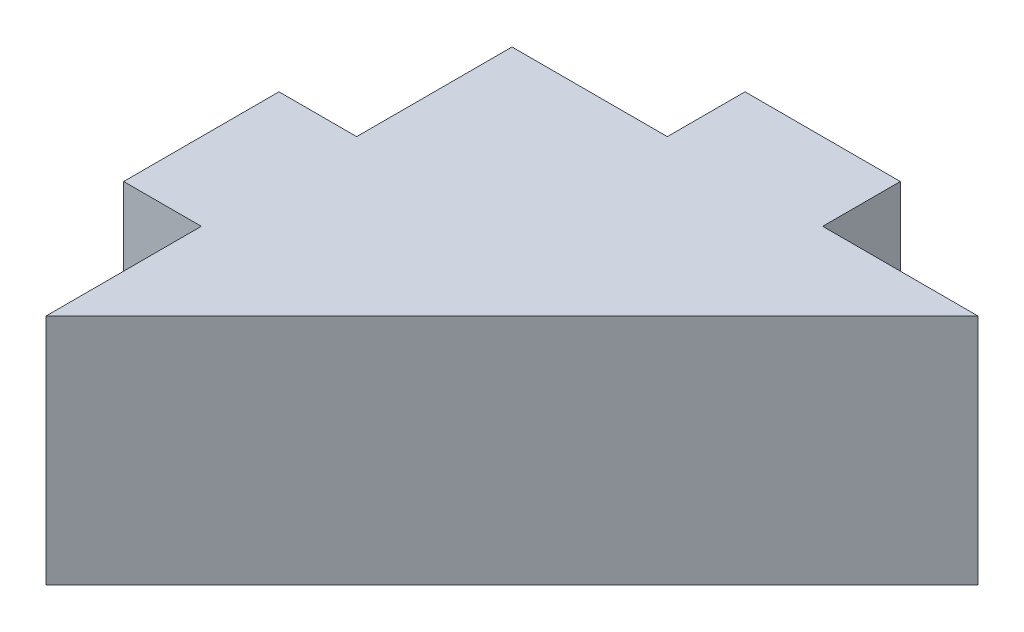
ISO-10303-21;
HEADER;
FILE_DESCRIPTION(('STEP AP214'),'2;1');
FILE_NAME('part.step','',(''),(''),'','','');
FILE_SCHEMA(('AUTOMOTIVE_DESIGN { 1 0 10303 214 1 1 1 1 }'));
ENDSEC;
DATA;
#1=APPLICATION_CONTEXT('core data for automotive mechanical design processes');
#2=APPLICATION_PROTOCOL_DEFINITION('international standard','automotive_design',2000,#1);
#3=PRODUCT_CONTEXT('',#1,'mechanical');
#4=PRODUCT('Part','Part','',(#3));
#5=PRODUCT_RELATED_PRODUCT_CATEGORY('part','',(#4));
#6=PRODUCT_DEFINITION_FORMATION('','',#4);
#7=PRODUCT_DEFINITION_CONTEXT('part definition',#1,'design');
#8=PRODUCT_DEFINITION('design','',#6,#7);
#9=PRODUCT_DEFINITION_SHAPE('','',#8);
#10=(LENGTH_UNIT() NAMED_UNIT(*) SI_UNIT(.MILLI.,.METRE.));
#11=(NAMED_UNIT(*) PLANE_ANGLE_UNIT() SI_UNIT($,.RADIAN.));
#12=(NAMED_UNIT(*) SI_UNIT($,.STERADIAN.) SOLID_ANGLE_UNIT());
#13=UNCERTAINTY_MEASURE_WITH_UNIT(LENGTH_MEASURE(1.E-05),#10,'distance_accuracy_value','');
#14=(GEOMETRIC_REPRESENTATION_CONTEXT(3) GLOBAL_UNCERTAINTY_ASSIGNED_CONTEXT((#13)) GLOBAL_UNIT_ASSIGNED_CONTEXT((#10,
#11,#12)) REPRESENTATION_CONTEXT('',''));
#15=CARTESIAN_POINT('',(0.,0.,0.));
#16=DIRECTION('',(0.,0.,1.));
#17=DIRECTION('',(1.,0.,0.));
#18=AXIS2_PLACEMENT_3D('',#15,#16,#17);
#19=CARTESIAN_POINT('',(0.,15.,0.));
#20=DIRECTION('',(1.,0.,0.));
#21=DIRECTION('',(0.,0.,-1.));
#22=AXIS2_PLACEMENT_3D('',#19,#20,#21);
#23=PLANE('',#22);
#24=DIRECTION('',(0.,0.,1.));
#25=VECTOR('',#24,1.);
#26=CARTESIAN_POINT('',(0.,15.,0.));
#27=LINE('',#26,#25);
#28=CARTESIAN_POINT('',(0.,15.,20.));
#29=VERTEX_POINT('',#28);
#30=CARTESIAN_POINT('',(0.,15.,30.));
#31=VERTEX_POINT('',#30);
#32=EDGE_CURVE('E209',#29,#31,#27,.T.);
#33=ORIENTED_EDGE('',*,*,#32,.F.);
#34=DIRECTION('',(0.,-1.,0.));
#35=VECTOR('',#34,1.);
#36=CARTESIAN_POINT('',(0.,15.,20.));
#37=LINE('',#36,#35);
#38=CARTESIAN_POINT('',(0.,0.,20.));
#39=VERTEX_POINT('',#38);
#40=EDGE_CURVE('E141',#29,#39,#37,.T.);
#41=ORIENTED_EDGE('',*,*,#40,.T.);
#42=DIRECTION('',(0.,0.,1.));
#43=VECTOR('',#42,1.);
#44=CARTESIAN_POINT('',(0.,0.,0.));
#45=LINE('',#44,#43);
#46=CARTESIAN_POINT('',(0.,0.,30.));
#47=VERTEX_POINT('',#46);
#48=EDGE_CURVE('E204',#39,#47,#45,.T.);
#49=ORIENTED_EDGE('',*,*,#48,.T.);
#50=DIRECTION('',(0.,-1.,0.));
#51=VECTOR('',#50,1.);
#52=CARTESIAN_POINT('',(0.,15.,30.));
#53=LINE('',#52,#51);
#54=EDGE_CURVE('E228',#31,#47,#53,.T.);
#55=ORIENTED_EDGE('',*,*,#54,.F.);
#56=EDGE_LOOP('',(#33,#41,#49,#55));
#57=FACE_BOUND('',#56,.T.);
#58=ADVANCED_FACE('F39',(#57),#23,.F.);
#59=CARTESIAN_POINT('',(0.,15.,0.));
#60=DIRECTION('',(0.,0.,1.));
#61=DIRECTION('',(1.,0.,0.));
#62=AXIS2_PLACEMENT_3D('',#59,#60,#61);
#63=PLANE('',#62);
#64=DIRECTION('',(0.,-1.,0.));
#65=VECTOR('',#64,1.);
#66=CARTESIAN_POINT('',(20.,15.,0.));
#67=LINE('',#66,#65);
#68=CARTESIAN_POINT('',(20.,15.,0.));
#69=VERTEX_POINT('',#68);
#70=CARTESIAN_POINT('',(20.,0.,0.));
#71=VERTEX_POINT('',#70);
#72=EDGE_CURVE('E63',#69,#71,#67,.T.);
#73=ORIENTED_EDGE('',*,*,#72,.F.);
#74=DIRECTION('',(-1.,0.,0.));
#75=VECTOR('',#74,1.);
#76=CARTESIAN_POINT('',(0.,15.,0.));
#77=LINE('',#76,#75);
#78=CARTESIAN_POINT('',(30.,15.,0.));
#79=VERTEX_POINT('',#78);
#80=EDGE_CURVE('E210',#79,#69,#77,.T.);
#81=ORIENTED_EDGE('',*,*,#80,.F.);
#82=DIRECTION('',(0.,-1.,0.));
#83=VECTOR('',#82,1.);
#84=CARTESIAN_POINT('',(30.,15.,0.));
#85=LINE('',#84,#83);
#86=CARTESIAN_POINT('',(30.,0.,0.));
#87=VERTEX_POINT('',#86);
#88=EDGE_CURVE('E224',#79,#87,#85,.T.);
#89=ORIENTED_EDGE('',*,*,#88,.T.);
#90=DIRECTION('',(-1.,0.,0.));
#91=VECTOR('',#90,1.);
#92=CARTESIAN_POINT('',(0.,0.,0.));
#93=LINE('',#92,#91);
#94=EDGE_CURVE('E218',#87,#71,#93,.T.);
#95=ORIENTED_EDGE('',*,*,#94,.T.);
#96=EDGE_LOOP('',(#73,#81,#89,#95));
#97=FACE_BOUND('',#96,.T.);
#98=ADVANCED_FACE('F243',(#97),#63,.F.);
#99=DIRECTION('',(0.,1.,0.));
#100=VECTOR('',#99,1.);
#101=CARTESIAN_POINT('',(10.,15.,0.));
#102=LINE('',#101,#100);
#103=CARTESIAN_POINT('',(9.99999999999999,0.,0.));
#104=VERTEX_POINT('',#103);
#105=CARTESIAN_POINT('',(10.,15.,0.));
#106=VERTEX_POINT('',#105);
#107=EDGE_CURVE('E174',#104,#106,#102,.T.);
#108=ORIENTED_EDGE('',*,*,#107,.F.);
#109=CARTESIAN_POINT('',(0.,0.,0.));
#110=VERTEX_POINT('',#109);
#111=EDGE_CURVE('E217',#104,#110,#93,.T.);
#112=ORIENTED_EDGE('',*,*,#111,.T.);
#113=DIRECTION('',(0.,-1.,0.));
#114=VECTOR('',#113,1.);
#115=CARTESIAN_POINT('',(0.,15.,0.));
#116=LINE('',#115,#114);
#117=CARTESIAN_POINT('',(0.,15.,0.));
#118=VERTEX_POINT('',#117);
#119=EDGE_CURVE('E213',#118,#110,#116,.T.);
#120=ORIENTED_EDGE('',*,*,#119,.F.);
#121=EDGE_CURVE('E208',#106,#118,#77,.T.);
#122=ORIENTED_EDGE('',*,*,#121,.F.);
#123=EDGE_LOOP('',(#108,#112,#120,#122));
#124=FACE_BOUND('',#123,.T.);
#125=ADVANCED_FACE('F258',(#124),#63,.F.);
#126=CARTESIAN_POINT('',(0.,0.,9.99999999999999));
#127=VERTEX_POINT('',#126);
#128=EDGE_CURVE('E214',#110,#127,#45,.T.);
#129=ORIENTED_EDGE('',*,*,#128,.T.);
#130=DIRECTION('',(0.,1.,0.));
#131=VECTOR('',#130,1.);
#132=CARTESIAN_POINT('',(0.,15.,10.));
#133=LINE('',#132,#131);
#134=CARTESIAN_POINT('',(0.,15.,9.99999999999999));
#135=VERTEX_POINT('',#134);
#136=EDGE_CURVE('E153',#127,#135,#133,.T.);
#137=ORIENTED_EDGE('',*,*,#136,.T.);
#138=EDGE_CURVE('E205',#118,#135,#27,.T.);
#139=ORIENTED_EDGE('',*,*,#138,.F.);
#140=ORIENTED_EDGE('',*,*,#119,.T.);
#141=EDGE_LOOP('',(#129,#137,#139,#140));
#142=FACE_BOUND('',#141,.T.);
#143=ADVANCED_FACE('F263',(#142),#23,.F.);
#144=CARTESIAN_POINT('',(0.,15.,0.));
#145=DIRECTION('',(0.,1.,0.));
#146=DIRECTION('',(0.,0.,1.));
#147=AXIS2_PLACEMENT_3D('',#144,#145,#146);
#148=PLANE('',#147);
#149=ORIENTED_EDGE('',*,*,#32,.T.);
#150=DIRECTION('',(-0.707106781186549,0.,0.707106781186546));
#151=VECTOR('',#150,1.);
#152=CARTESIAN_POINT('',(14.9999999999999,15.,15.));
#153=LINE('',#152,#151);
#154=EDGE_CURVE('E11',#31,#79,#153,.F.);
#155=ORIENTED_EDGE('',*,*,#154,.T.);
#156=ORIENTED_EDGE('',*,*,#80,.T.);
#157=DIRECTION('',(0.,0.,1.));
#158=VECTOR('',#157,1.);
#159=CARTESIAN_POINT('',(20.,15.,-5.));
#160=LINE('',#159,#158);
#161=CARTESIAN_POINT('',(20.,15.,-5.));
#162=VERTEX_POINT('',#161);
#163=EDGE_CURVE('E183',#162,#69,#160,.T.);
#164=ORIENTED_EDGE('',*,*,#163,.F.);
#165=DIRECTION('',(1.,0.,0.));
#166=VECTOR('',#165,1.);
#167=CARTESIAN_POINT('',(20.,15.,-5.));
#168=LINE('',#167,#166);
#169=CARTESIAN_POINT('',(10.,15.,-5.));
#170=VERTEX_POINT('',#169);
#171=EDGE_CURVE('E180',#170,#162,#168,.T.);
#172=ORIENTED_EDGE('',*,*,#171,.F.);
#173=DIRECTION('',(0.,0.,1.));
#174=VECTOR('',#173,1.);
#175=CARTESIAN_POINT('',(10.,15.,-5.));
#176=LINE('',#175,#174);
#177=EDGE_CURVE('E192',#170,#106,#176,.T.);
#178=ORIENTED_EDGE('',*,*,#177,.T.);
#179=ORIENTED_EDGE('',*,*,#121,.T.);
#180=ORIENTED_EDGE('',*,*,#138,.T.);
#181=DIRECTION('',(1.,0.,0.));
#182=VECTOR('',#181,1.);
#183=CARTESIAN_POINT('',(-5.,15.,10.));
#184=LINE('',#183,#182);
#185=CARTESIAN_POINT('',(-5.,15.,10.));
#186=VERTEX_POINT('',#185);
#187=EDGE_CURVE('E55',#186,#135,#184,.T.);
#188=ORIENTED_EDGE('',*,*,#187,.F.);
#189=DIRECTION('',(0.,0.,1.));
#190=VECTOR('',#189,1.);
#191=CARTESIAN_POINT('',(-5.,15.,20.));
#192=LINE('',#191,#190);
#193=CARTESIAN_POINT('',(-5.,15.,20.));
#194=VERTEX_POINT('',#193);
#195=EDGE_CURVE('E150',#186,#194,#192,.T.);
#196=ORIENTED_EDGE('',*,*,#195,.T.);
#197=DIRECTION('',(1.,0.,0.));
#198=VECTOR('',#197,1.);
#199=CARTESIAN_POINT('',(-5.,15.,20.));
#200=LINE('',#199,#198);
#201=EDGE_CURVE('E135',#194,#29,#200,.T.);
#202=ORIENTED_EDGE('',*,*,#201,.T.);
#203=EDGE_LOOP('',(#149,#155,#156,#164,#172,#178,#179,#180,#188,#196,#202));
#204=FACE_BOUND('',#203,.T.);
#205=ADVANCED_FACE('F155',(#204),#148,.T.);
#206=CARTESIAN_POINT('',(0.,0.,0.));
#207=DIRECTION('',(0.,1.,0.));
#208=DIRECTION('',(0.,0.,1.));
#209=AXIS2_PLACEMENT_3D('',#206,#207,#208);
#210=PLANE('',#209);
#211=ORIENTED_EDGE('',*,*,#94,.F.);
#212=DIRECTION('',(0.707106781186549,0.,-0.707106781186546));
#213=VECTOR('',#212,1.);
#214=CARTESIAN_POINT('',(30.,0.,0.));
#215=LINE('',#214,#213);
#216=EDGE_CURVE('E48',#87,#47,#215,.F.);
#217=ORIENTED_EDGE('',*,*,#216,.T.);
#218=ORIENTED_EDGE('',*,*,#48,.F.);
#219=DIRECTION('',(1.,0.,0.));
#220=VECTOR('',#219,1.);
#221=CARTESIAN_POINT('',(-5.,0.,20.));
#222=LINE('',#221,#220);
#223=CARTESIAN_POINT('',(-5.,0.,20.));
#224=VERTEX_POINT('',#223);
#225=EDGE_CURVE('E162',#224,#39,#222,.T.);
#226=ORIENTED_EDGE('',*,*,#225,.F.);
#227=DIRECTION('',(0.,0.,-1.));
#228=VECTOR('',#227,1.);
#229=CARTESIAN_POINT('',(-5.,0.,20.));
#230=LINE('',#229,#228);
#231=CARTESIAN_POINT('',(-5.,0.,9.99999999999999));
#232=VERTEX_POINT('',#231);
#233=EDGE_CURVE('E152',#224,#232,#230,.T.);
#234=ORIENTED_EDGE('',*,*,#233,.T.);
#235=DIRECTION('',(1.,0.,0.));
#236=VECTOR('',#235,1.);
#237=CARTESIAN_POINT('',(-5.,0.,9.99999999999999));
#238=LINE('',#237,#236);
#239=EDGE_CURVE('E166',#232,#127,#238,.T.);
#240=ORIENTED_EDGE('',*,*,#239,.T.);
#241=ORIENTED_EDGE('',*,*,#128,.F.);
#242=ORIENTED_EDGE('',*,*,#111,.F.);
#243=DIRECTION('',(0.,0.,1.));
#244=VECTOR('',#243,1.);
#245=CARTESIAN_POINT('',(9.99999999999999,0.,-5.));
#246=LINE('',#245,#244);
#247=CARTESIAN_POINT('',(9.99999999999999,0.,-5.));
#248=VERTEX_POINT('',#247);
#249=EDGE_CURVE('E196',#248,#104,#246,.T.);
#250=ORIENTED_EDGE('',*,*,#249,.F.);
#251=DIRECTION('',(-1.,0.,0.));
#252=VECTOR('',#251,1.);
#253=CARTESIAN_POINT('',(20.,0.,-5.));
#254=LINE('',#253,#252);
#255=CARTESIAN_POINT('',(20.,0.,-5.));
#256=VERTEX_POINT('',#255);
#257=EDGE_CURVE('E173',#256,#248,#254,.T.);
#258=ORIENTED_EDGE('',*,*,#257,.F.);
#259=DIRECTION('',(0.,0.,1.));
#260=VECTOR('',#259,1.);
#261=CARTESIAN_POINT('',(20.,0.,-5.));
#262=LINE('',#261,#260);
#263=EDGE_CURVE('E200',#256,#71,#262,.T.);
#264=ORIENTED_EDGE('',*,*,#263,.T.);
#265=EDGE_LOOP('',(#211,#217,#218,#226,#234,#240,#241,#242,#250,#258,#264));
#266=FACE_BOUND('',#265,.T.);
#267=ADVANCED_FACE('F236',(#266),#210,.F.);
#268=CARTESIAN_POINT('',(20.,15.,-5.));
#269=DIRECTION('',(-1.,0.,0.));
#270=DIRECTION('',(0.,-1.,0.));
#271=AXIS2_PLACEMENT_3D('',#268,#269,#270);
#272=PLANE('',#271);
#273=ORIENTED_EDGE('',*,*,#72,.T.);
#274=ORIENTED_EDGE('',*,*,#263,.F.);
#275=DIRECTION('',(0.,-1.,0.));
#276=VECTOR('',#275,1.);
#277=CARTESIAN_POINT('',(20.,15.,-5.));
#278=LINE('',#277,#276);
#279=EDGE_CURVE('E169',#162,#256,#278,.T.);
#280=ORIENTED_EDGE('',*,*,#279,.F.);
#281=ORIENTED_EDGE('',*,*,#163,.T.);
#282=EDGE_LOOP('',(#273,#274,#280,#281));
#283=FACE_BOUND('',#282,.T.);
#284=ADVANCED_FACE('F248',(#283),#272,.F.);
#285=CARTESIAN_POINT('',(10.,15.,-5.));
#286=DIRECTION('',(1.,0.,0.));
#287=DIRECTION('',(0.,1.,0.));
#288=AXIS2_PLACEMENT_3D('',#285,#286,#287);
#289=PLANE('',#288);
#290=ORIENTED_EDGE('',*,*,#107,.T.);
#291=ORIENTED_EDGE('',*,*,#177,.F.);
#292=DIRECTION('',(0.,1.,0.));
#293=VECTOR('',#292,1.);
#294=CARTESIAN_POINT('',(10.,15.,-5.));
#295=LINE('',#294,#293);
#296=EDGE_CURVE('E177',#248,#170,#295,.T.);
#297=ORIENTED_EDGE('',*,*,#296,.F.);
#298=ORIENTED_EDGE('',*,*,#249,.T.);
#299=EDGE_LOOP('',(#290,#291,#297,#298));
#300=FACE_BOUND('',#299,.T.);
#301=ADVANCED_FACE('F255',(#300),#289,.F.);
#302=CARTESIAN_POINT('',(0.,0.,-5.));
#303=DIRECTION('',(0.,0.,-1.));
#304=DIRECTION('',(-1.,0.,0.));
#305=AXIS2_PLACEMENT_3D('',#302,#303,#304);
#306=PLANE('',#305);
#307=ORIENTED_EDGE('',*,*,#279,.T.);
#308=ORIENTED_EDGE('',*,*,#257,.T.);
#309=ORIENTED_EDGE('',*,*,#296,.T.);
#310=ORIENTED_EDGE('',*,*,#171,.T.);
#311=EDGE_LOOP('',(#307,#308,#309,#310));
#312=FACE_BOUND('',#311,.T.);
#313=ADVANCED_FACE('F252',(#312),#306,.T.);
#314=CARTESIAN_POINT('',(-5.,15.,20.));
#315=DIRECTION('',(0.,0.,1.));
#316=DIRECTION('',(0.,-1.,0.));
#317=AXIS2_PLACEMENT_3D('',#314,#315,#316);
#318=PLANE('',#317);
#319=ORIENTED_EDGE('',*,*,#40,.F.);
#320=ORIENTED_EDGE('',*,*,#201,.F.);
#321=DIRECTION('',(0.,-1.,0.));
#322=VECTOR('',#321,1.);
#323=CARTESIAN_POINT('',(-5.,15.,20.));
#324=LINE('',#323,#322);
#325=EDGE_CURVE('E138',#194,#224,#324,.T.);
#326=ORIENTED_EDGE('',*,*,#325,.T.);
#327=ORIENTED_EDGE('',*,*,#225,.T.);
#328=EDGE_LOOP('',(#319,#320,#326,#327));
#329=FACE_BOUND('',#328,.T.);
#330=ADVANCED_FACE('F137',(#329),#318,.T.);
#331=CARTESIAN_POINT('',(-5.,15.,10.));
#332=DIRECTION('',(0.,0.,-1.));
#333=DIRECTION('',(0.,1.,0.));
#334=AXIS2_PLACEMENT_3D('',#331,#332,#333);
#335=PLANE('',#334);
#336=ORIENTED_EDGE('',*,*,#136,.F.);
#337=ORIENTED_EDGE('',*,*,#239,.F.);
#338=DIRECTION('',(0.,1.,0.));
#339=VECTOR('',#338,1.);
#340=CARTESIAN_POINT('',(-5.,15.,10.));
#341=LINE('',#340,#339);
#342=EDGE_CURVE('E157',#232,#186,#341,.T.);
#343=ORIENTED_EDGE('',*,*,#342,.T.);
#344=ORIENTED_EDGE('',*,*,#187,.T.);
#345=EDGE_LOOP('',(#336,#337,#343,#344));
#346=FACE_BOUND('',#345,.T.);
#347=ADVANCED_FACE('F267',(#346),#335,.T.);
#348=CARTESIAN_POINT('',(-5.,0.,0.));
#349=DIRECTION('',(-1.,0.,0.));
#350=DIRECTION('',(0.,0.,-1.));
#351=AXIS2_PLACEMENT_3D('',#348,#349,#350);
#352=PLANE('',#351);
#353=ORIENTED_EDGE('',*,*,#325,.F.);
#354=ORIENTED_EDGE('',*,*,#195,.F.);
#355=ORIENTED_EDGE('',*,*,#342,.F.);
#356=ORIENTED_EDGE('',*,*,#233,.F.);
#357=EDGE_LOOP('',(#353,#354,#355,#356));
#358=FACE_BOUND('',#357,.T.);
#359=ADVANCED_FACE('F148',(#358),#352,.T.);
#360=CARTESIAN_POINT('',(30.,15.,0.));
#361=DIRECTION('',(-0.707106781186546,0.,-0.707106781186549));
#362=DIRECTION('',(0.,-1.,0.));
#363=AXIS2_PLACEMENT_3D('',#360,#361,#362);
#364=PLANE('',#363);
#365=ORIENTED_EDGE('',*,*,#154,.F.);
#366=ORIENTED_EDGE('',*,*,#54,.T.);
#367=ORIENTED_EDGE('',*,*,#216,.F.);
#368=ORIENTED_EDGE('',*,*,#88,.F.);
#369=EDGE_LOOP('',(#365,#366,#367,#368));
#370=FACE_BOUND('',#369,.T.);
#371=ADVANCED_FACE('F41',(#370),#364,.F.);
#372=CLOSED_SHELL('',(#58,#98,#125,#143,#205,#267,#284,#301,#313,#330,#347,#359,#371));
#373=MANIFOLD_SOLID_BREP('B2',#372);
#374=ADVANCED_BREP_SHAPE_REPRESENTATION('',(#18,#373),#14);
#375=SHAPE_DEFINITION_REPRESENTATION(#9,#374);
ENDSEC;
END-ISO-10303-21;
